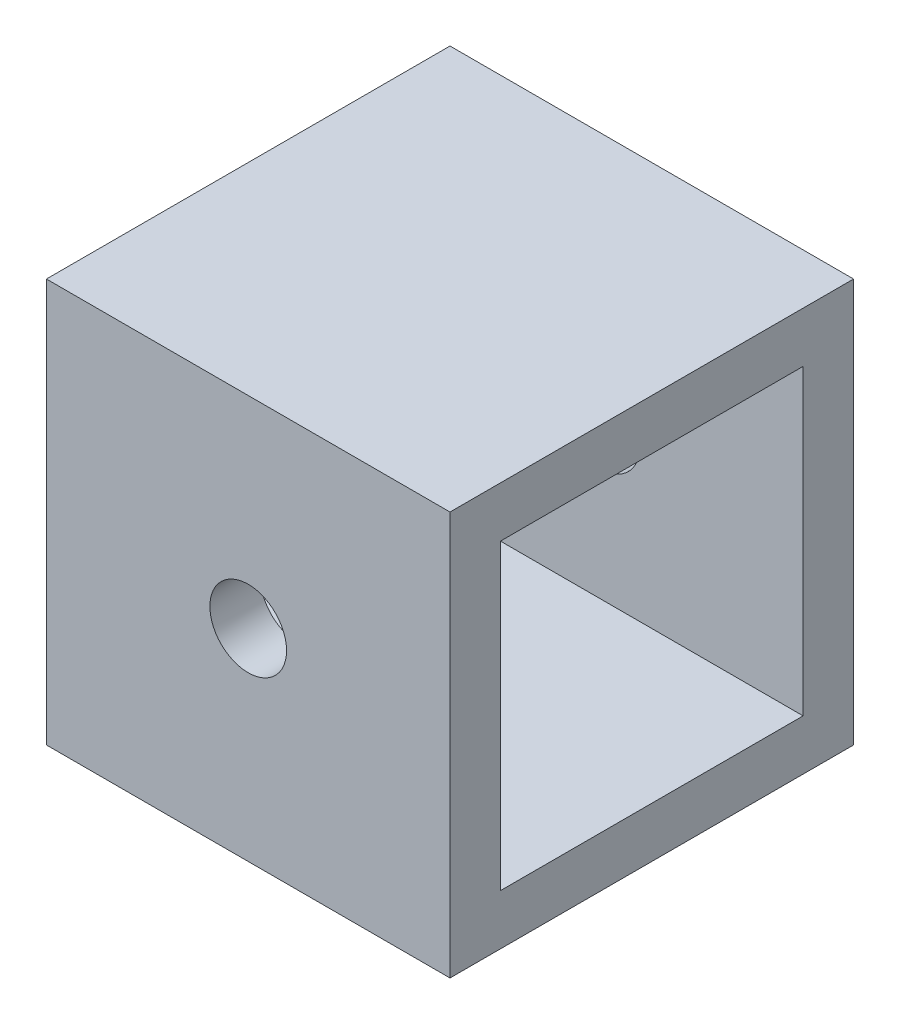
ISO-10303-21;
HEADER;
FILE_DESCRIPTION(('STEP AP214'),'2;1');
FILE_NAME('part.step','',(''),(''),'','','');
FILE_SCHEMA(('AUTOMOTIVE_DESIGN { 1 0 10303 214 1 1 1 1 }'));
ENDSEC;
DATA;
#1=APPLICATION_CONTEXT('core data for automotive mechanical design processes');
#2=APPLICATION_PROTOCOL_DEFINITION('international standard','automotive_design',2000,#1);
#3=PRODUCT_CONTEXT('',#1,'mechanical');
#4=PRODUCT('Part','Part','',(#3));
#5=PRODUCT_RELATED_PRODUCT_CATEGORY('part','',(#4));
#6=PRODUCT_DEFINITION_FORMATION('','',#4);
#7=PRODUCT_DEFINITION_CONTEXT('part definition',#1,'design');
#8=PRODUCT_DEFINITION('design','',#6,#7);
#9=PRODUCT_DEFINITION_SHAPE('','',#8);
#10=(LENGTH_UNIT() NAMED_UNIT(*) SI_UNIT(.MILLI.,.METRE.));
#11=(NAMED_UNIT(*) PLANE_ANGLE_UNIT() SI_UNIT($,.RADIAN.));
#12=(NAMED_UNIT(*) SI_UNIT($,.STERADIAN.) SOLID_ANGLE_UNIT());
#13=UNCERTAINTY_MEASURE_WITH_UNIT(LENGTH_MEASURE(1.E-05),#10,'distance_accuracy_value','');
#14=(GEOMETRIC_REPRESENTATION_CONTEXT(3) GLOBAL_UNCERTAINTY_ASSIGNED_CONTEXT((#13)) GLOBAL_UNIT_ASSIGNED_CONTEXT((#10,
#11,#12)) REPRESENTATION_CONTEXT('',''));
#15=CARTESIAN_POINT('',(0.,0.,0.));
#16=DIRECTION('',(0.,0.,1.));
#17=DIRECTION('',(1.,0.,0.));
#18=AXIS2_PLACEMENT_3D('',#15,#16,#17);
#19=CARTESIAN_POINT('',(25.4,0.,0.));
#20=DIRECTION('',(1.,0.,0.));
#21=DIRECTION('',(0.,0.,-1.));
#22=AXIS2_PLACEMENT_3D('',#19,#20,#21);
#23=PLANE('',#22);
#24=DIRECTION('',(0.,-1.,0.));
#25=VECTOR('',#24,1.);
#26=CARTESIAN_POINT('',(25.4,0.,0.));
#27=LINE('',#26,#25);
#28=CARTESIAN_POINT('',(25.4,25.4,0.));
#29=VERTEX_POINT('',#28);
#30=CARTESIAN_POINT('',(25.4,0.,0.));
#31=VERTEX_POINT('',#30);
#32=EDGE_CURVE('E162',#29,#31,#27,.T.);
#33=ORIENTED_EDGE('',*,*,#32,.T.);
#34=DIRECTION('',(0.,0.,-1.));
#35=VECTOR('',#34,1.);
#36=CARTESIAN_POINT('',(25.4,0.,0.));
#37=LINE('',#36,#35);
#38=CARTESIAN_POINT('',(25.4,0.,-25.4));
#39=VERTEX_POINT('',#38);
#40=EDGE_CURVE('E165',#31,#39,#37,.T.);
#41=ORIENTED_EDGE('',*,*,#40,.T.);
#42=DIRECTION('',(0.,1.,0.));
#43=VECTOR('',#42,1.);
#44=CARTESIAN_POINT('',(25.4,0.,-25.4));
#45=LINE('',#44,#43);
#46=CARTESIAN_POINT('',(25.4,25.4,-25.4));
#47=VERTEX_POINT('',#46);
#48=EDGE_CURVE('E168',#39,#47,#45,.T.);
#49=ORIENTED_EDGE('',*,*,#48,.T.);
#50=DIRECTION('',(0.,0.,1.));
#51=VECTOR('',#50,1.);
#52=CARTESIAN_POINT('',(25.4,25.4,0.));
#53=LINE('',#52,#51);
#54=EDGE_CURVE('E170',#47,#29,#53,.T.);
#55=ORIENTED_EDGE('',*,*,#54,.T.);
#56=EDGE_LOOP('',(#33,#41,#49,#55));
#57=FACE_BOUND('',#56,.T.);
#58=DIRECTION('',(0.,0.,-1.));
#59=VECTOR('',#58,1.);
#60=CARTESIAN_POINT('',(25.4,3.175,0.));
#61=LINE('',#60,#59);
#62=CARTESIAN_POINT('',(25.4,3.175,-3.175));
#63=VERTEX_POINT('',#62);
#64=CARTESIAN_POINT('',(25.4,3.175,-22.225));
#65=VERTEX_POINT('',#64);
#66=EDGE_CURVE('E132',#63,#65,#61,.T.);
#67=ORIENTED_EDGE('',*,*,#66,.F.);
#68=DIRECTION('',(0.,-1.,0.));
#69=VECTOR('',#68,1.);
#70=CARTESIAN_POINT('',(25.4,0.,-3.175));
#71=LINE('',#70,#69);
#72=CARTESIAN_POINT('',(25.4,22.225,-3.175));
#73=VERTEX_POINT('',#72);
#74=EDGE_CURVE('E124',#73,#63,#71,.T.);
#75=ORIENTED_EDGE('',*,*,#74,.F.);
#76=DIRECTION('',(0.,0.,1.));
#77=VECTOR('',#76,1.);
#78=CARTESIAN_POINT('',(25.4,22.225,0.));
#79=LINE('',#78,#77);
#80=CARTESIAN_POINT('',(25.4,22.225,-22.225));
#81=VERTEX_POINT('',#80);
#82=EDGE_CURVE('E146',#81,#73,#79,.T.);
#83=ORIENTED_EDGE('',*,*,#82,.F.);
#84=DIRECTION('',(0.,1.,0.));
#85=VECTOR('',#84,1.);
#86=CARTESIAN_POINT('',(25.4,0.,-22.225));
#87=LINE('',#86,#85);
#88=EDGE_CURVE('E144',#65,#81,#87,.T.);
#89=ORIENTED_EDGE('',*,*,#88,.F.);
#90=EDGE_LOOP('',(#67,#75,#83,#89));
#91=FACE_BOUND('',#90,.T.);
#92=ADVANCED_FACE('F58',(#57,#91),#23,.T.);
#93=CARTESIAN_POINT('',(0.,0.,0.));
#94=DIRECTION('',(1.,0.,0.));
#95=DIRECTION('',(0.,0.,-1.));
#96=AXIS2_PLACEMENT_3D('',#93,#94,#95);
#97=PLANE('',#96);
#98=DIRECTION('',(0.,-1.,0.));
#99=VECTOR('',#98,1.);
#100=CARTESIAN_POINT('',(0.,0.,0.));
#101=LINE('',#100,#99);
#102=CARTESIAN_POINT('',(0.,25.4,0.));
#103=VERTEX_POINT('',#102);
#104=CARTESIAN_POINT('',(0.,0.,0.));
#105=VERTEX_POINT('',#104);
#106=EDGE_CURVE('E140',#103,#105,#101,.T.);
#107=ORIENTED_EDGE('',*,*,#106,.F.);
#108=DIRECTION('',(0.,0.,1.));
#109=VECTOR('',#108,1.);
#110=CARTESIAN_POINT('',(0.,25.4,0.));
#111=LINE('',#110,#109);
#112=CARTESIAN_POINT('',(0.,25.4,-25.4));
#113=VERTEX_POINT('',#112);
#114=EDGE_CURVE('E166',#113,#103,#111,.T.);
#115=ORIENTED_EDGE('',*,*,#114,.F.);
#116=DIRECTION('',(0.,1.,0.));
#117=VECTOR('',#116,1.);
#118=CARTESIAN_POINT('',(0.,0.,-25.4));
#119=LINE('',#118,#117);
#120=CARTESIAN_POINT('',(0.,0.,-25.4));
#121=VERTEX_POINT('',#120);
#122=EDGE_CURVE('E177',#121,#113,#119,.T.);
#123=ORIENTED_EDGE('',*,*,#122,.F.);
#124=DIRECTION('',(0.,0.,-1.));
#125=VECTOR('',#124,1.);
#126=CARTESIAN_POINT('',(0.,0.,0.));
#127=LINE('',#126,#125);
#128=EDGE_CURVE('E175',#105,#121,#127,.T.);
#129=ORIENTED_EDGE('',*,*,#128,.F.);
#130=EDGE_LOOP('',(#107,#115,#123,#129));
#131=FACE_BOUND('',#130,.T.);
#132=DIRECTION('',(0.,-1.,0.));
#133=VECTOR('',#132,1.);
#134=CARTESIAN_POINT('',(0.,0.,-3.175));
#135=LINE('',#134,#133);
#136=CARTESIAN_POINT('',(0.,22.225,-3.175));
#137=VERTEX_POINT('',#136);
#138=CARTESIAN_POINT('',(0.,3.175,-3.175));
#139=VERTEX_POINT('',#138);
#140=EDGE_CURVE('E82',#137,#139,#135,.T.);
#141=ORIENTED_EDGE('',*,*,#140,.T.);
#142=DIRECTION('',(0.,0.,-1.));
#143=VECTOR('',#142,1.);
#144=CARTESIAN_POINT('',(0.,3.175,0.));
#145=LINE('',#144,#143);
#146=CARTESIAN_POINT('',(0.,3.175,-22.225));
#147=VERTEX_POINT('',#146);
#148=EDGE_CURVE('E139',#139,#147,#145,.T.);
#149=ORIENTED_EDGE('',*,*,#148,.T.);
#150=DIRECTION('',(0.,1.,0.));
#151=VECTOR('',#150,1.);
#152=CARTESIAN_POINT('',(0.,0.,-22.225));
#153=LINE('',#152,#151);
#154=CARTESIAN_POINT('',(0.,22.225,-22.225));
#155=VERTEX_POINT('',#154);
#156=EDGE_CURVE('E154',#147,#155,#153,.T.);
#157=ORIENTED_EDGE('',*,*,#156,.T.);
#158=DIRECTION('',(0.,0.,1.));
#159=VECTOR('',#158,1.);
#160=CARTESIAN_POINT('',(0.,22.225,0.));
#161=LINE('',#160,#159);
#162=EDGE_CURVE('E133',#155,#137,#161,.T.);
#163=ORIENTED_EDGE('',*,*,#162,.T.);
#164=EDGE_LOOP('',(#141,#149,#157,#163));
#165=FACE_BOUND('',#164,.T.);
#166=ADVANCED_FACE('F196',(#131,#165),#97,.F.);
#167=CARTESIAN_POINT('',(25.4,0.,0.));
#168=DIRECTION('',(0.,0.,-1.));
#169=DIRECTION('',(-1.,0.,0.));
#170=AXIS2_PLACEMENT_3D('',#167,#168,#169);
#171=PLANE('',#170);
#172=CARTESIAN_POINT('',(12.7,12.7,0.));
#173=DIRECTION('',(0.,0.,1.));
#174=DIRECTION('',(1.,0.,0.));
#175=AXIS2_PLACEMENT_3D('',#172,#173,#174);
#176=CIRCLE('',#175,2.413);
#177=CARTESIAN_POINT('',(15.113,12.7,0.));
#178=VERTEX_POINT('',#177);
#179=EDGE_CURVE('E239',#178,#178,#176,.T.);
#180=ORIENTED_EDGE('',*,*,#179,.F.);
#181=EDGE_LOOP('',(#180));
#182=FACE_BOUND('',#181,.T.);
#183=ORIENTED_EDGE('',*,*,#106,.T.);
#184=DIRECTION('',(-1.,0.,0.));
#185=VECTOR('',#184,1.);
#186=CARTESIAN_POINT('',(25.4,0.,0.));
#187=LINE('',#186,#185);
#188=EDGE_CURVE('E12',#31,#105,#187,.T.);
#189=ORIENTED_EDGE('',*,*,#188,.F.);
#190=ORIENTED_EDGE('',*,*,#32,.F.);
#191=DIRECTION('',(-1.,0.,0.));
#192=VECTOR('',#191,1.);
#193=CARTESIAN_POINT('',(25.4,25.4,0.));
#194=LINE('',#193,#192);
#195=EDGE_CURVE('E172',#29,#103,#194,.T.);
#196=ORIENTED_EDGE('',*,*,#195,.T.);
#197=EDGE_LOOP('',(#183,#189,#190,#196));
#198=FACE_BOUND('',#197,.T.);
#199=ADVANCED_FACE('F60',(#182,#198),#171,.F.);
#200=CARTESIAN_POINT('',(25.4,0.,0.));
#201=DIRECTION('',(0.,1.,0.));
#202=DIRECTION('',(0.,0.,1.));
#203=AXIS2_PLACEMENT_3D('',#200,#201,#202);
#204=PLANE('',#203);
#205=ORIENTED_EDGE('',*,*,#128,.T.);
#206=DIRECTION('',(-1.,0.,0.));
#207=VECTOR('',#206,1.);
#208=CARTESIAN_POINT('',(25.4,0.,-25.4));
#209=LINE('',#208,#207);
#210=EDGE_CURVE('E67',#39,#121,#209,.T.);
#211=ORIENTED_EDGE('',*,*,#210,.F.);
#212=ORIENTED_EDGE('',*,*,#40,.F.);
#213=ORIENTED_EDGE('',*,*,#188,.T.);
#214=EDGE_LOOP('',(#205,#211,#212,#213));
#215=FACE_BOUND('',#214,.T.);
#216=ADVANCED_FACE('F206',(#215),#204,.F.);
#217=CARTESIAN_POINT('',(25.4,0.,-25.4));
#218=DIRECTION('',(0.,0.,1.));
#219=DIRECTION('',(1.,0.,0.));
#220=AXIS2_PLACEMENT_3D('',#217,#218,#219);
#221=PLANE('',#220);
#222=CARTESIAN_POINT('',(12.7,12.7,-25.4));
#223=DIRECTION('',(0.,0.,1.));
#224=DIRECTION('',(1.,0.,0.));
#225=AXIS2_PLACEMENT_3D('',#222,#223,#224);
#226=CIRCLE('',#225,2.413);
#227=CARTESIAN_POINT('',(15.113,12.7,-25.4));
#228=VERTEX_POINT('',#227);
#229=EDGE_CURVE('E237',#228,#228,#226,.T.);
#230=ORIENTED_EDGE('',*,*,#229,.T.);
#231=EDGE_LOOP('',(#230));
#232=FACE_BOUND('',#231,.T.);
#233=ORIENTED_EDGE('',*,*,#122,.T.);
#234=DIRECTION('',(-1.,0.,0.));
#235=VECTOR('',#234,1.);
#236=CARTESIAN_POINT('',(25.4,25.4,-25.4));
#237=LINE('',#236,#235);
#238=EDGE_CURVE('E182',#47,#113,#237,.T.);
#239=ORIENTED_EDGE('',*,*,#238,.F.);
#240=ORIENTED_EDGE('',*,*,#48,.F.);
#241=ORIENTED_EDGE('',*,*,#210,.T.);
#242=EDGE_LOOP('',(#233,#239,#240,#241));
#243=FACE_BOUND('',#242,.T.);
#244=ADVANCED_FACE('F190',(#232,#243),#221,.F.);
#245=CARTESIAN_POINT('',(25.4,25.4,0.));
#246=DIRECTION('',(0.,-1.,0.));
#247=DIRECTION('',(0.,0.,-1.));
#248=AXIS2_PLACEMENT_3D('',#245,#246,#247);
#249=PLANE('',#248);
#250=ORIENTED_EDGE('',*,*,#114,.T.);
#251=ORIENTED_EDGE('',*,*,#195,.F.);
#252=ORIENTED_EDGE('',*,*,#54,.F.);
#253=ORIENTED_EDGE('',*,*,#238,.T.);
#254=EDGE_LOOP('',(#250,#251,#252,#253));
#255=FACE_BOUND('',#254,.T.);
#256=ADVANCED_FACE('F200',(#255),#249,.F.);
#257=CARTESIAN_POINT('',(25.4,0.,-3.175));
#258=DIRECTION('',(0.,0.,-1.));
#259=DIRECTION('',(-1.,0.,0.));
#260=AXIS2_PLACEMENT_3D('',#257,#258,#259);
#261=PLANE('',#260);
#262=CARTESIAN_POINT('',(12.7,12.7,-3.175));
#263=DIRECTION('',(0.,0.,-1.));
#264=DIRECTION('',(-1.,0.,0.));
#265=AXIS2_PLACEMENT_3D('',#262,#263,#264);
#266=CIRCLE('',#265,2.413);
#267=CARTESIAN_POINT('',(10.287,12.7,-3.175));
#268=VERTEX_POINT('',#267);
#269=EDGE_CURVE('E152',#268,#268,#266,.T.);
#270=ORIENTED_EDGE('',*,*,#269,.F.);
#271=EDGE_LOOP('',(#270));
#272=FACE_BOUND('',#271,.T.);
#273=ORIENTED_EDGE('',*,*,#140,.F.);
#274=DIRECTION('',(-1.,0.,0.));
#275=VECTOR('',#274,1.);
#276=CARTESIAN_POINT('',(25.4,22.225,-3.175));
#277=LINE('',#276,#275);
#278=EDGE_CURVE('E128',#73,#137,#277,.T.);
#279=ORIENTED_EDGE('',*,*,#278,.F.);
#280=ORIENTED_EDGE('',*,*,#74,.T.);
#281=DIRECTION('',(-1.,0.,0.));
#282=VECTOR('',#281,1.);
#283=CARTESIAN_POINT('',(25.4,3.175,-3.175));
#284=LINE('',#283,#282);
#285=EDGE_CURVE('E127',#63,#139,#284,.T.);
#286=ORIENTED_EDGE('',*,*,#285,.T.);
#287=EDGE_LOOP('',(#273,#279,#280,#286));
#288=FACE_BOUND('',#287,.T.);
#289=ADVANCED_FACE('F126',(#272,#288),#261,.T.);
#290=CARTESIAN_POINT('',(25.4,3.175,0.));
#291=DIRECTION('',(0.,1.,0.));
#292=DIRECTION('',(0.,0.,1.));
#293=AXIS2_PLACEMENT_3D('',#290,#291,#292);
#294=PLANE('',#293);
#295=ORIENTED_EDGE('',*,*,#148,.F.);
#296=ORIENTED_EDGE('',*,*,#285,.F.);
#297=ORIENTED_EDGE('',*,*,#66,.T.);
#298=DIRECTION('',(-1.,0.,0.));
#299=VECTOR('',#298,1.);
#300=CARTESIAN_POINT('',(25.4,3.175,-22.225));
#301=LINE('',#300,#299);
#302=EDGE_CURVE('E141',#65,#147,#301,.T.);
#303=ORIENTED_EDGE('',*,*,#302,.T.);
#304=EDGE_LOOP('',(#295,#296,#297,#303));
#305=FACE_BOUND('',#304,.T.);
#306=ADVANCED_FACE('F136',(#305),#294,.T.);
#307=CARTESIAN_POINT('',(25.4,0.,-22.225));
#308=DIRECTION('',(0.,0.,1.));
#309=DIRECTION('',(1.,0.,0.));
#310=AXIS2_PLACEMENT_3D('',#307,#308,#309);
#311=PLANE('',#310);
#312=CARTESIAN_POINT('',(12.7,12.7,-22.225));
#313=DIRECTION('',(0.,0.,1.));
#314=DIRECTION('',(1.,0.,0.));
#315=AXIS2_PLACEMENT_3D('',#312,#313,#314);
#316=CIRCLE('',#315,2.413);
#317=CARTESIAN_POINT('',(15.113,12.7,-22.225));
#318=VERTEX_POINT('',#317);
#319=EDGE_CURVE('E62',#318,#318,#316,.T.);
#320=ORIENTED_EDGE('',*,*,#319,.F.);
#321=EDGE_LOOP('',(#320));
#322=FACE_BOUND('',#321,.T.);
#323=ORIENTED_EDGE('',*,*,#156,.F.);
#324=ORIENTED_EDGE('',*,*,#302,.F.);
#325=ORIENTED_EDGE('',*,*,#88,.T.);
#326=DIRECTION('',(-1.,0.,0.));
#327=VECTOR('',#326,1.);
#328=CARTESIAN_POINT('',(25.4,22.225,-22.225));
#329=LINE('',#328,#327);
#330=EDGE_CURVE('E74',#81,#155,#329,.T.);
#331=ORIENTED_EDGE('',*,*,#330,.T.);
#332=EDGE_LOOP('',(#323,#324,#325,#331));
#333=FACE_BOUND('',#332,.T.);
#334=ADVANCED_FACE('F232',(#322,#333),#311,.T.);
#335=CARTESIAN_POINT('',(25.4,22.225,0.));
#336=DIRECTION('',(0.,-1.,0.));
#337=DIRECTION('',(0.,0.,-1.));
#338=AXIS2_PLACEMENT_3D('',#335,#336,#337);
#339=PLANE('',#338);
#340=ORIENTED_EDGE('',*,*,#162,.F.);
#341=ORIENTED_EDGE('',*,*,#330,.F.);
#342=ORIENTED_EDGE('',*,*,#82,.T.);
#343=ORIENTED_EDGE('',*,*,#278,.T.);
#344=EDGE_LOOP('',(#340,#341,#342,#343));
#345=FACE_BOUND('',#344,.T.);
#346=ADVANCED_FACE('F248',(#345),#339,.T.);
#347=CARTESIAN_POINT('',(12.7,12.7,-25.4));
#348=DIRECTION('',(0.,0.,1.));
#349=DIRECTION('',(1.,0.,0.));
#350=AXIS2_PLACEMENT_3D('',#347,#348,#349);
#351=CYLINDRICAL_SURFACE('',#350,2.413);
#352=ORIENTED_EDGE('',*,*,#319,.T.);
#353=EDGE_LOOP('',(#352));
#354=FACE_BOUND('',#353,.T.);
#355=ORIENTED_EDGE('',*,*,#229,.F.);
#356=EDGE_LOOP('',(#355));
#357=FACE_BOUND('',#356,.T.);
#358=ADVANCED_FACE('F245',(#354,#357),#351,.F.);
#359=ORIENTED_EDGE('',*,*,#269,.T.);
#360=EDGE_LOOP('',(#359));
#361=FACE_BOUND('',#360,.T.);
#362=ORIENTED_EDGE('',*,*,#179,.T.);
#363=EDGE_LOOP('',(#362));
#364=FACE_BOUND('',#363,.T.);
#365=ADVANCED_FACE('F247',(#361,#364),#351,.F.);
#366=CLOSED_SHELL('',(#92,#166,#199,#216,#244,#256,#289,#306,#334,#346,#358,#365));
#367=MANIFOLD_SOLID_BREP('B2',#366);
#368=ADVANCED_BREP_SHAPE_REPRESENTATION('',(#18,#367),#14);
#369=SHAPE_DEFINITION_REPRESENTATION(#9,#368);
ENDSEC;
END-ISO-10303-21;
